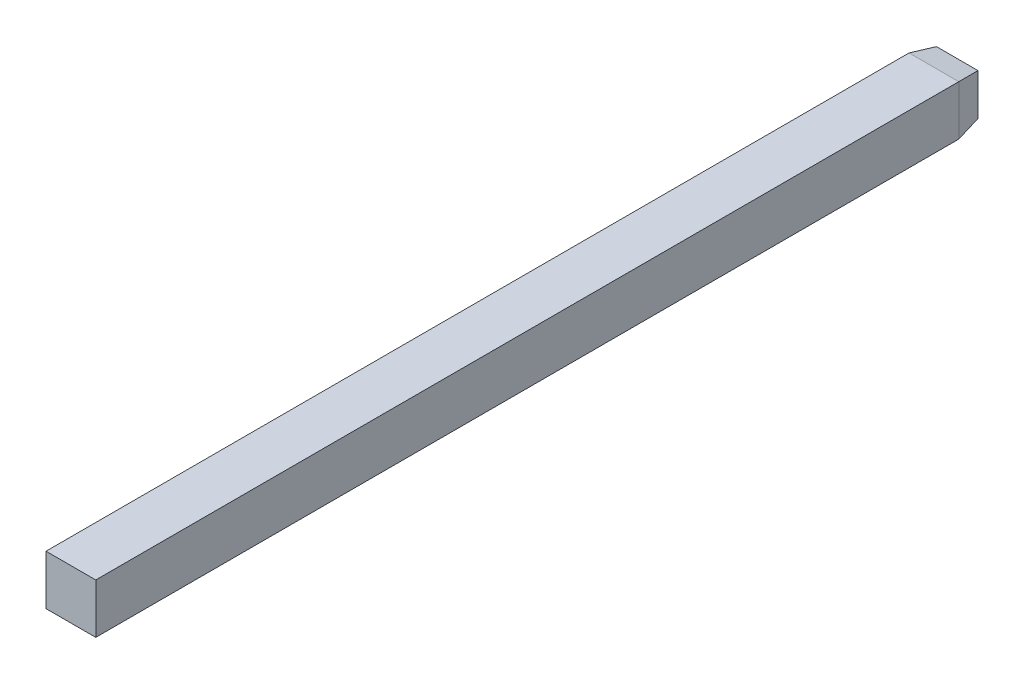
ISO-10303-21;
HEADER;
FILE_DESCRIPTION(('STEP AP214'),'2;1');
FILE_NAME('part.step','',(''),(''),'','','');
FILE_SCHEMA(('AUTOMOTIVE_DESIGN { 1 0 10303 214 1 1 1 1 }'));
ENDSEC;
DATA;
#1=APPLICATION_CONTEXT('core data for automotive mechanical design processes');
#2=APPLICATION_PROTOCOL_DEFINITION('international standard','automotive_design',2000,#1);
#3=PRODUCT_CONTEXT('',#1,'mechanical');
#4=PRODUCT('Part','Part','',(#3));
#5=PRODUCT_RELATED_PRODUCT_CATEGORY('part','',(#4));
#6=PRODUCT_DEFINITION_FORMATION('','',#4);
#7=PRODUCT_DEFINITION_CONTEXT('part definition',#1,'design');
#8=PRODUCT_DEFINITION('design','',#6,#7);
#9=PRODUCT_DEFINITION_SHAPE('','',#8);
#10=(LENGTH_UNIT() NAMED_UNIT(*) SI_UNIT(.MILLI.,.METRE.));
#11=(NAMED_UNIT(*) PLANE_ANGLE_UNIT() SI_UNIT($,.RADIAN.));
#12=(NAMED_UNIT(*) SI_UNIT($,.STERADIAN.) SOLID_ANGLE_UNIT());
#13=UNCERTAINTY_MEASURE_WITH_UNIT(LENGTH_MEASURE(1.E-05),#10,'distance_accuracy_value','');
#14=(GEOMETRIC_REPRESENTATION_CONTEXT(3) GLOBAL_UNCERTAINTY_ASSIGNED_CONTEXT((#13)) GLOBAL_UNIT_ASSIGNED_CONTEXT((#10,
#11,#12)) REPRESENTATION_CONTEXT('',''));
#15=CARTESIAN_POINT('',(0.,0.,0.));
#16=DIRECTION('',(0.,0.,1.));
#17=DIRECTION('',(1.,0.,0.));
#18=AXIS2_PLACEMENT_3D('',#15,#16,#17);
#19=CARTESIAN_POINT('',(0.32,-0.32,0.300000000000005));
#20=DIRECTION('',(0.,-0.984807753012209,-0.173648177666927));
#21=DIRECTION('',(0.,0.173648177666927,-0.984807753012209));
#22=AXIS2_PLACEMENT_3D('',#19,#20,#21);
#23=PLANE('',#22);
#24=DIRECTION('',(0.171087869746032,0.171087869746032,-0.970287525247815));
#25=VECTOR('',#24,1.);
#26=CARTESIAN_POINT('',(-0.301266522128489,-0.301266522128488,0.193757167529094));
#27=LINE('',#26,#25);
#28=CARTESIAN_POINT('',(-0.32,-0.32,0.300000000000005));
#29=VERTEX_POINT('',#28);
#30=CARTESIAN_POINT('',(-0.267101905787461,-0.267101905787459,0.));
#31=VERTEX_POINT('',#30);
#32=EDGE_CURVE('E26',#29,#31,#27,.T.);
#33=ORIENTED_EDGE('',*,*,#32,.T.);
#34=DIRECTION('',(-1.,0.,0.));
#35=VECTOR('',#34,1.);
#36=CARTESIAN_POINT('',(-0.32,-0.267101905787459,0.));
#37=LINE('',#36,#35);
#38=CARTESIAN_POINT('',(0.267101905787461,-0.267101905787459,0.));
#39=VERTEX_POINT('',#38);
#40=EDGE_CURVE('E148',#39,#31,#37,.T.);
#41=ORIENTED_EDGE('',*,*,#40,.F.);
#42=DIRECTION('',(0.171087869746032,-0.171087869746032,0.970287525247815));
#43=VECTOR('',#42,1.);
#44=CARTESIAN_POINT('',(0.301266522128489,-0.301266522128488,0.193757167529094));
#45=LINE('',#44,#43);
#46=CARTESIAN_POINT('',(0.32,-0.32,0.300000000000005));
#47=VERTEX_POINT('',#46);
#48=EDGE_CURVE('E11',#39,#47,#45,.T.);
#49=ORIENTED_EDGE('',*,*,#48,.T.);
#50=DIRECTION('',(1.,0.,0.));
#51=VECTOR('',#50,1.);
#52=CARTESIAN_POINT('',(0.32,-0.32,0.300000000000005));
#53=LINE('',#52,#51);
#54=EDGE_CURVE('E155',#29,#47,#53,.T.);
#55=ORIENTED_EDGE('',*,*,#54,.F.);
#56=EDGE_LOOP('',(#33,#41,#49,#55));
#57=FACE_BOUND('',#56,.T.);
#58=ADVANCED_FACE('F17',(#57),#23,.T.);
#59=CARTESIAN_POINT('',(0.32,0.32,0.300000000000005));
#60=DIRECTION('',(0.984807753012209,0.,-0.173648177666927));
#61=DIRECTION('',(0.,-1.,0.));
#62=AXIS2_PLACEMENT_3D('',#59,#60,#61);
#63=PLANE('',#62);
#64=DIRECTION('',(0.171087869746032,0.171087869746032,0.970287525247815));
#65=VECTOR('',#64,1.);
#66=CARTESIAN_POINT('',(0.32,0.32,0.300000000000005));
#67=LINE('',#66,#65);
#68=CARTESIAN_POINT('',(0.267101905787461,0.267101905787463,0.));
#69=VERTEX_POINT('',#68);
#70=CARTESIAN_POINT('',(0.32,0.32,0.300000000000005));
#71=VERTEX_POINT('',#70);
#72=EDGE_CURVE('E58',#69,#71,#67,.T.);
#73=ORIENTED_EDGE('',*,*,#72,.T.);
#74=DIRECTION('',(0.,1.,0.));
#75=VECTOR('',#74,1.);
#76=CARTESIAN_POINT('',(0.32,0.32,0.300000000000005));
#77=LINE('',#76,#75);
#78=EDGE_CURVE('E146',#47,#71,#77,.T.);
#79=ORIENTED_EDGE('',*,*,#78,.F.);
#80=ORIENTED_EDGE('',*,*,#48,.F.);
#81=DIRECTION('',(0.,-1.,0.));
#82=VECTOR('',#81,1.);
#83=CARTESIAN_POINT('',(0.267101905787461,-0.32,0.));
#84=LINE('',#83,#82);
#85=EDGE_CURVE('E153',#69,#39,#84,.T.);
#86=ORIENTED_EDGE('',*,*,#85,.F.);
#87=EDGE_LOOP('',(#73,#79,#80,#86));
#88=FACE_BOUND('',#87,.T.);
#89=ADVANCED_FACE('F186',(#88),#63,.T.);
#90=CARTESIAN_POINT('',(-0.32,0.32,0.300000000000005));
#91=DIRECTION('',(-0.984807753012209,0.,-0.173648177666927));
#92=DIRECTION('',(-0.173648177666927,0.,0.984807753012209));
#93=AXIS2_PLACEMENT_3D('',#90,#91,#92);
#94=PLANE('',#93);
#95=DIRECTION('',(0.171087869746032,-0.171087869746032,-0.970287525247815));
#96=VECTOR('',#95,1.);
#97=CARTESIAN_POINT('',(-0.32,0.32,0.300000000000005));
#98=LINE('',#97,#96);
#99=CARTESIAN_POINT('',(-0.32,0.32,0.300000000000005));
#100=VERTEX_POINT('',#99);
#101=CARTESIAN_POINT('',(-0.267101905787461,0.267101905787463,0.));
#102=VERTEX_POINT('',#101);
#103=EDGE_CURVE('E39',#100,#102,#98,.T.);
#104=ORIENTED_EDGE('',*,*,#103,.T.);
#105=DIRECTION('',(0.,1.,0.));
#106=VECTOR('',#105,1.);
#107=CARTESIAN_POINT('',(-0.267101905787461,0.32,0.));
#108=LINE('',#107,#106);
#109=EDGE_CURVE('E152',#31,#102,#108,.T.);
#110=ORIENTED_EDGE('',*,*,#109,.F.);
#111=ORIENTED_EDGE('',*,*,#32,.F.);
#112=DIRECTION('',(0.,-1.,0.));
#113=VECTOR('',#112,1.);
#114=CARTESIAN_POINT('',(-0.32,-0.32,0.300000000000005));
#115=LINE('',#114,#113);
#116=EDGE_CURVE('E127',#100,#29,#115,.T.);
#117=ORIENTED_EDGE('',*,*,#116,.F.);
#118=EDGE_LOOP('',(#104,#110,#111,#117));
#119=FACE_BOUND('',#118,.T.);
#120=ADVANCED_FACE('F128',(#119),#94,.T.);
#121=CARTESIAN_POINT('',(0.32,0.32,0.300000000000005));
#122=DIRECTION('',(0.,0.984807753012209,-0.173648177666927));
#123=DIRECTION('',(-1.,0.,0.));
#124=AXIS2_PLACEMENT_3D('',#121,#122,#123);
#125=PLANE('',#124);
#126=ORIENTED_EDGE('',*,*,#72,.F.);
#127=DIRECTION('',(1.,0.,0.));
#128=VECTOR('',#127,1.);
#129=CARTESIAN_POINT('',(0.32,0.267101905787463,0.));
#130=LINE('',#129,#128);
#131=EDGE_CURVE('E115',#102,#69,#130,.T.);
#132=ORIENTED_EDGE('',*,*,#131,.F.);
#133=ORIENTED_EDGE('',*,*,#103,.F.);
#134=DIRECTION('',(-1.,0.,0.));
#135=VECTOR('',#134,1.);
#136=CARTESIAN_POINT('',(-0.32,0.32,0.300000000000005));
#137=LINE('',#136,#135);
#138=EDGE_CURVE('E114',#71,#100,#137,.T.);
#139=ORIENTED_EDGE('',*,*,#138,.F.);
#140=EDGE_LOOP('',(#126,#132,#133,#139));
#141=FACE_BOUND('',#140,.T.);
#142=ADVANCED_FACE('F113',(#141),#125,.T.);
#143=CARTESIAN_POINT('',(-0.32,-0.32,0.));
#144=DIRECTION('',(0.,0.,-1.));
#145=DIRECTION('',(0.,-1.,0.));
#146=AXIS2_PLACEMENT_3D('',#143,#144,#145);
#147=PLANE('',#146);
#148=ORIENTED_EDGE('',*,*,#85,.T.);
#149=ORIENTED_EDGE('',*,*,#40,.T.);
#150=ORIENTED_EDGE('',*,*,#109,.T.);
#151=ORIENTED_EDGE('',*,*,#131,.T.);
#152=EDGE_LOOP('',(#148,#149,#150,#151));
#153=FACE_BOUND('',#152,.T.);
#154=ADVANCED_FACE('F183',(#153),#147,.T.);
#155=CARTESIAN_POINT('',(-0.32,-0.32,11.4));
#156=DIRECTION('',(0.,0.,-1.));
#157=DIRECTION('',(0.,-1.,0.));
#158=AXIS2_PLACEMENT_3D('',#155,#156,#157);
#159=PLANE('',#158);
#160=DIRECTION('',(0.,-1.,0.));
#161=VECTOR('',#160,1.);
#162=CARTESIAN_POINT('',(-0.32,0.32,11.4));
#163=LINE('',#162,#161);
#164=CARTESIAN_POINT('',(-0.32,0.32,11.4));
#165=VERTEX_POINT('',#164);
#166=CARTESIAN_POINT('',(-0.32,-0.32,11.4));
#167=VERTEX_POINT('',#166);
#168=EDGE_CURVE('E135',#165,#167,#163,.T.);
#169=ORIENTED_EDGE('',*,*,#168,.T.);
#170=DIRECTION('',(1.,0.,0.));
#171=VECTOR('',#170,1.);
#172=CARTESIAN_POINT('',(0.32,-0.32,11.4));
#173=LINE('',#172,#171);
#174=CARTESIAN_POINT('',(0.32,-0.32,11.4));
#175=VERTEX_POINT('',#174);
#176=EDGE_CURVE('E143',#167,#175,#173,.T.);
#177=ORIENTED_EDGE('',*,*,#176,.T.);
#178=DIRECTION('',(0.,1.,0.));
#179=VECTOR('',#178,1.);
#180=CARTESIAN_POINT('',(0.32,0.32,11.4));
#181=LINE('',#180,#179);
#182=CARTESIAN_POINT('',(0.32,0.32,11.4));
#183=VERTEX_POINT('',#182);
#184=EDGE_CURVE('E92',#175,#183,#181,.T.);
#185=ORIENTED_EDGE('',*,*,#184,.T.);
#186=DIRECTION('',(-1.,0.,0.));
#187=VECTOR('',#186,1.);
#188=CARTESIAN_POINT('',(0.32,0.32,11.4));
#189=LINE('',#188,#187);
#190=EDGE_CURVE('E71',#183,#165,#189,.T.);
#191=ORIENTED_EDGE('',*,*,#190,.T.);
#192=EDGE_LOOP('',(#169,#177,#185,#191));
#193=FACE_BOUND('',#192,.T.);
#194=ADVANCED_FACE('F191',(#193),#159,.F.);
#195=CARTESIAN_POINT('',(0.32,0.32,11.4));
#196=DIRECTION('',(0.,-1.,0.));
#197=DIRECTION('',(0.,0.,-1.));
#198=AXIS2_PLACEMENT_3D('',#195,#196,#197);
#199=PLANE('',#198);
#200=DIRECTION('',(0.,0.,-1.));
#201=VECTOR('',#200,1.);
#202=CARTESIAN_POINT('',(0.32,0.32,11.4));
#203=LINE('',#202,#201);
#204=EDGE_CURVE('E122',#183,#71,#203,.T.);
#205=ORIENTED_EDGE('',*,*,#204,.T.);
#206=ORIENTED_EDGE('',*,*,#138,.T.);
#207=DIRECTION('',(0.,0.,-1.));
#208=VECTOR('',#207,1.);
#209=CARTESIAN_POINT('',(-0.32,0.32,11.4));
#210=LINE('',#209,#208);
#211=EDGE_CURVE('E121',#165,#100,#210,.T.);
#212=ORIENTED_EDGE('',*,*,#211,.F.);
#213=ORIENTED_EDGE('',*,*,#190,.F.);
#214=EDGE_LOOP('',(#205,#206,#212,#213));
#215=FACE_BOUND('',#214,.T.);
#216=ADVANCED_FACE('F119',(#215),#199,.F.);
#217=CARTESIAN_POINT('',(0.32,0.32,11.4));
#218=DIRECTION('',(-1.,0.,0.));
#219=DIRECTION('',(0.,0.,1.));
#220=AXIS2_PLACEMENT_3D('',#217,#218,#219);
#221=PLANE('',#220);
#222=DIRECTION('',(0.,0.,-1.));
#223=VECTOR('',#222,1.);
#224=CARTESIAN_POINT('',(0.32,-0.32,11.4));
#225=LINE('',#224,#223);
#226=EDGE_CURVE('E147',#175,#47,#225,.T.);
#227=ORIENTED_EDGE('',*,*,#226,.T.);
#228=ORIENTED_EDGE('',*,*,#78,.T.);
#229=ORIENTED_EDGE('',*,*,#204,.F.);
#230=ORIENTED_EDGE('',*,*,#184,.F.);
#231=EDGE_LOOP('',(#227,#228,#229,#230));
#232=FACE_BOUND('',#231,.T.);
#233=ADVANCED_FACE('F188',(#232),#221,.F.);
#234=CARTESIAN_POINT('',(0.32,-0.32,11.4));
#235=DIRECTION('',(0.,1.,0.));
#236=DIRECTION('',(1.,0.,0.));
#237=AXIS2_PLACEMENT_3D('',#234,#235,#236);
#238=PLANE('',#237);
#239=DIRECTION('',(0.,0.,-1.));
#240=VECTOR('',#239,1.);
#241=CARTESIAN_POINT('',(-0.32,-0.32,11.4));
#242=LINE('',#241,#240);
#243=EDGE_CURVE('E132',#167,#29,#242,.T.);
#244=ORIENTED_EDGE('',*,*,#243,.T.);
#245=ORIENTED_EDGE('',*,*,#54,.T.);
#246=ORIENTED_EDGE('',*,*,#226,.F.);
#247=ORIENTED_EDGE('',*,*,#176,.F.);
#248=EDGE_LOOP('',(#244,#245,#246,#247));
#249=FACE_BOUND('',#248,.T.);
#250=ADVANCED_FACE('F190',(#249),#238,.F.);
#251=CARTESIAN_POINT('',(-0.32,0.32,11.4));
#252=DIRECTION('',(1.,0.,0.));
#253=DIRECTION('',(0.,1.,0.));
#254=AXIS2_PLACEMENT_3D('',#251,#252,#253);
#255=PLANE('',#254);
#256=ORIENTED_EDGE('',*,*,#211,.T.);
#257=ORIENTED_EDGE('',*,*,#116,.T.);
#258=ORIENTED_EDGE('',*,*,#243,.F.);
#259=ORIENTED_EDGE('',*,*,#168,.F.);
#260=EDGE_LOOP('',(#256,#257,#258,#259));
#261=FACE_BOUND('',#260,.T.);
#262=ADVANCED_FACE('F134',(#261),#255,.F.);
#263=CLOSED_SHELL('',(#58,#89,#120,#142,#154,#194,#216,#233,#250,#262));
#264=MANIFOLD_SOLID_BREP('B1',#263);
#265=ADVANCED_BREP_SHAPE_REPRESENTATION('',(#18,#264),#14);
#266=SHAPE_DEFINITION_REPRESENTATION(#9,#265);
ENDSEC;
END-ISO-10303-21;
